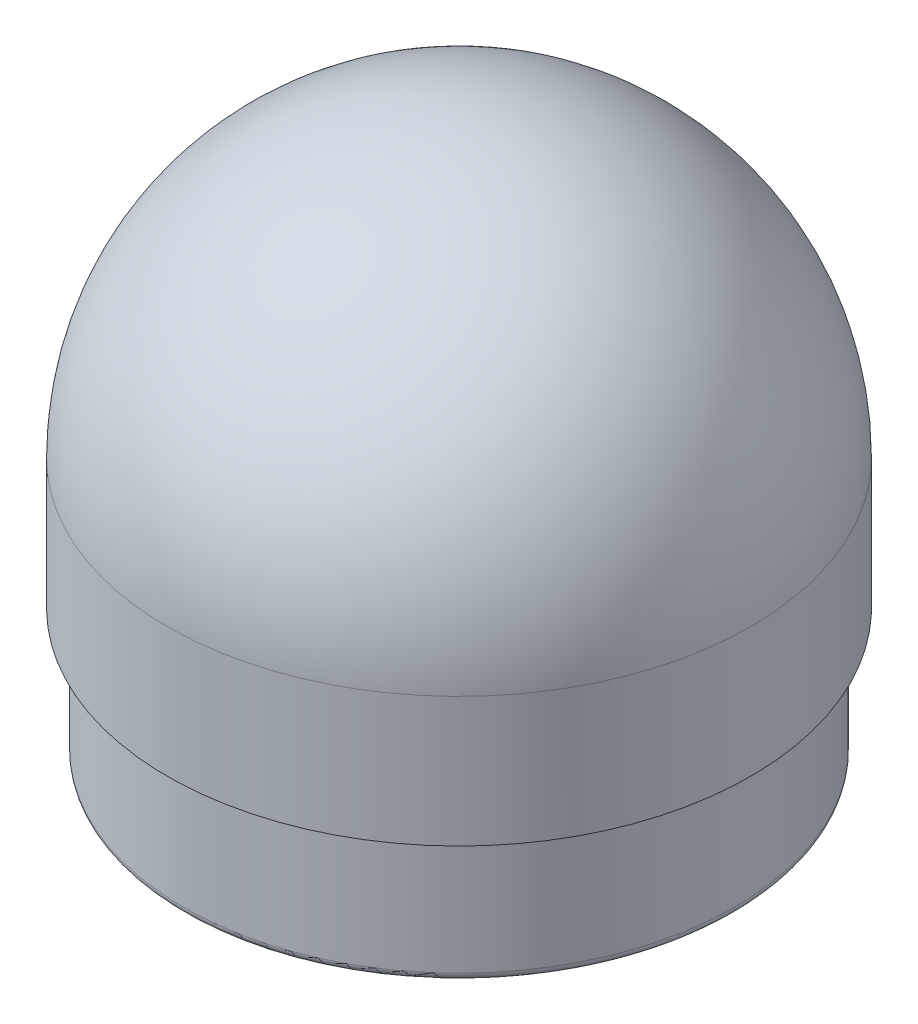
ISO-10303-21;
HEADER;
FILE_DESCRIPTION(('STEP AP214'),'2;1');
FILE_NAME('part.step','',(''),(''),'','','');
FILE_SCHEMA(('AUTOMOTIVE_DESIGN { 1 0 10303 214 1 1 1 1 }'));
ENDSEC;
DATA;
#1=APPLICATION_CONTEXT('core data for automotive mechanical design processes');
#2=APPLICATION_PROTOCOL_DEFINITION('international standard','automotive_design',2000,#1);
#3=PRODUCT_CONTEXT('',#1,'mechanical');
#4=PRODUCT('Part','Part','',(#3));
#5=PRODUCT_RELATED_PRODUCT_CATEGORY('part','',(#4));
#6=PRODUCT_DEFINITION_FORMATION('','',#4);
#7=PRODUCT_DEFINITION_CONTEXT('part definition',#1,'design');
#8=PRODUCT_DEFINITION('design','',#6,#7);
#9=PRODUCT_DEFINITION_SHAPE('','',#8);
#10=(LENGTH_UNIT() NAMED_UNIT(*) SI_UNIT(.MILLI.,.METRE.));
#11=(NAMED_UNIT(*) PLANE_ANGLE_UNIT() SI_UNIT($,.RADIAN.));
#12=(NAMED_UNIT(*) SI_UNIT($,.STERADIAN.) SOLID_ANGLE_UNIT());
#13=UNCERTAINTY_MEASURE_WITH_UNIT(LENGTH_MEASURE(1.E-05),#10,'distance_accuracy_value','');
#14=(GEOMETRIC_REPRESENTATION_CONTEXT(3) GLOBAL_UNCERTAINTY_ASSIGNED_CONTEXT((#13)) GLOBAL_UNIT_ASSIGNED_CONTEXT((#10,
#11,#12)) REPRESENTATION_CONTEXT('',''));
#15=CARTESIAN_POINT('',(0.,0.,0.));
#16=DIRECTION('',(0.,0.,1.));
#17=DIRECTION('',(1.,0.,0.));
#18=AXIS2_PLACEMENT_3D('',#15,#16,#17);
#19=CARTESIAN_POINT('',(0.,98.425,0.));
#20=DIRECTION('',(0.,-1.,0.));
#21=DIRECTION('',(0.,0.,-1.));
#22=AXIS2_PLACEMENT_3D('',#19,#20,#21);
#23=CYLINDRICAL_SURFACE('',#22,47.625);
#24=CARTESIAN_POINT('',(0.,0.,0.));
#25=DIRECTION('',(0.,-1.,0.));
#26=DIRECTION('',(0.,0.,-1.));
#27=AXIS2_PLACEMENT_3D('',#24,#25,#26);
#28=CIRCLE('',#27,47.625);
#29=CARTESIAN_POINT('',(0.,0.,-47.625));
#30=VERTEX_POINT('',#29);
#31=EDGE_CURVE('E10',#30,#30,#28,.T.);
#32=ORIENTED_EDGE('',*,*,#31,.T.);
#33=EDGE_LOOP('',(#32));
#34=FACE_BOUND('',#33,.T.);
#35=CARTESIAN_POINT('',(0.,50.8,0.));
#36=DIRECTION('',(0.,-1.,0.));
#37=DIRECTION('',(0.,0.,-1.));
#38=AXIS2_PLACEMENT_3D('',#35,#36,#37);
#39=CIRCLE('',#38,47.625);
#40=CARTESIAN_POINT('',(0.,50.8,-47.625));
#41=VERTEX_POINT('',#40);
#42=EDGE_CURVE('E56',#41,#41,#39,.T.);
#43=ORIENTED_EDGE('',*,*,#42,.F.);
#44=EDGE_LOOP('',(#43));
#45=FACE_BOUND('',#44,.T.);
#46=ADVANCED_FACE('F31',(#34,#45),#23,.F.);
#47=CARTESIAN_POINT('',(47.625,0.,0.));
#48=DIRECTION('',(0.,-1.,0.));
#49=DIRECTION('',(0.,0.,-1.));
#50=AXIS2_PLACEMENT_3D('',#47,#48,#49);
#51=PLANE('',#50);
#52=CARTESIAN_POINT('',(0.,0.,0.));
#53=DIRECTION('',(0.,-1.,0.));
#54=DIRECTION('',(0.,0.,-1.));
#55=AXIS2_PLACEMENT_3D('',#52,#53,#54);
#56=CIRCLE('',#55,52.3875);
#57=CARTESIAN_POINT('',(0.,0.,-52.3875));
#58=VERTEX_POINT('',#57);
#59=EDGE_CURVE('E37',#58,#58,#56,.T.);
#60=ORIENTED_EDGE('',*,*,#59,.T.);
#61=EDGE_LOOP('',(#60));
#62=FACE_BOUND('',#61,.T.);
#63=ORIENTED_EDGE('',*,*,#31,.F.);
#64=EDGE_LOOP('',(#63));
#65=FACE_BOUND('',#64,.T.);
#66=ADVANCED_FACE('F63',(#62,#65),#51,.T.);
#67=CARTESIAN_POINT('',(0.,1.5875,0.));
#68=DIRECTION('',(0.,-1.,0.));
#69=DIRECTION('',(0.,0.,-1.));
#70=AXIS2_PLACEMENT_3D('',#67,#68,#69);
#71=TOROIDAL_SURFACE('',#70,52.3875,1.5875);
#72=CARTESIAN_POINT('',(0.,1.58750000000001,0.));
#73=DIRECTION('',(0.,-1.,0.));
#74=DIRECTION('',(0.,0.,-1.));
#75=AXIS2_PLACEMENT_3D('',#72,#73,#74);
#76=CIRCLE('',#75,53.975);
#77=CARTESIAN_POINT('',(0.,1.58750000000001,-53.975));
#78=VERTEX_POINT('',#77);
#79=EDGE_CURVE('E41',#78,#78,#76,.T.);
#80=ORIENTED_EDGE('',*,*,#79,.T.);
#81=EDGE_LOOP('',(#80));
#82=FACE_BOUND('',#81,.T.);
#83=ORIENTED_EDGE('',*,*,#59,.F.);
#84=EDGE_LOOP('',(#83));
#85=FACE_BOUND('',#84,.T.);
#86=ADVANCED_FACE('F67',(#82,#85),#71,.T.);
#87=CARTESIAN_POINT('',(0.,98.425,0.));
#88=DIRECTION('',(0.,-1.,0.));
#89=DIRECTION('',(0.,0.,-1.));
#90=AXIS2_PLACEMENT_3D('',#87,#88,#89);
#91=CYLINDRICAL_SURFACE('',#90,53.975);
#92=CARTESIAN_POINT('',(0.,25.4,0.));
#93=DIRECTION('',(0.,-1.,0.));
#94=DIRECTION('',(0.,0.,-1.));
#95=AXIS2_PLACEMENT_3D('',#92,#93,#94);
#96=CIRCLE('',#95,53.975);
#97=CARTESIAN_POINT('',(0.,25.4,-53.975));
#98=VERTEX_POINT('',#97);
#99=EDGE_CURVE('E45',#98,#98,#96,.T.);
#100=ORIENTED_EDGE('',*,*,#99,.T.);
#101=EDGE_LOOP('',(#100));
#102=FACE_BOUND('',#101,.T.);
#103=ORIENTED_EDGE('',*,*,#79,.F.);
#104=EDGE_LOOP('',(#103));
#105=FACE_BOUND('',#104,.T.);
#106=ADVANCED_FACE('F71',(#102,#105),#91,.T.);
#107=CARTESIAN_POINT('',(53.975,25.4,0.));
#108=DIRECTION('',(0.,-1.,0.));
#109=DIRECTION('',(0.,0.,-1.));
#110=AXIS2_PLACEMENT_3D('',#107,#108,#109);
#111=PLANE('',#110);
#112=CARTESIAN_POINT('',(0.,25.4,0.));
#113=DIRECTION('',(0.,-1.,0.));
#114=DIRECTION('',(0.,0.,-1.));
#115=AXIS2_PLACEMENT_3D('',#112,#113,#114);
#116=CIRCLE('',#115,57.15);
#117=CARTESIAN_POINT('',(0.,25.4,-57.15));
#118=VERTEX_POINT('',#117);
#119=EDGE_CURVE('E50',#118,#118,#116,.T.);
#120=ORIENTED_EDGE('',*,*,#119,.T.);
#121=EDGE_LOOP('',(#120));
#122=FACE_BOUND('',#121,.T.);
#123=ORIENTED_EDGE('',*,*,#99,.F.);
#124=EDGE_LOOP('',(#123));
#125=FACE_BOUND('',#124,.T.);
#126=ADVANCED_FACE('F78',(#122,#125),#111,.T.);
#127=CARTESIAN_POINT('',(0.,98.425,0.));
#128=DIRECTION('',(0.,-1.,0.));
#129=DIRECTION('',(0.,0.,-1.));
#130=AXIS2_PLACEMENT_3D('',#127,#128,#129);
#131=CYLINDRICAL_SURFACE('',#130,57.15);
#132=CARTESIAN_POINT('',(0.,50.8,0.));
#133=DIRECTION('',(0.,-1.,0.));
#134=DIRECTION('',(0.,0.,-1.));
#135=AXIS2_PLACEMENT_3D('',#132,#133,#134);
#136=CIRCLE('',#135,57.15);
#137=CARTESIAN_POINT('',(0.,50.8,-57.15));
#138=VERTEX_POINT('',#137);
#139=EDGE_CURVE('E53',#138,#138,#136,.T.);
#140=ORIENTED_EDGE('',*,*,#139,.T.);
#141=EDGE_LOOP('',(#140));
#142=FACE_BOUND('',#141,.T.);
#143=ORIENTED_EDGE('',*,*,#119,.F.);
#144=EDGE_LOOP('',(#143));
#145=FACE_BOUND('',#144,.T.);
#146=ADVANCED_FACE('F82',(#142,#145),#131,.T.);
#147=CARTESIAN_POINT('',(0.,50.8,0.));
#148=DIRECTION('',(0.,-1.,0.));
#149=DIRECTION('',(1.,0.,0.));
#150=AXIS2_PLACEMENT_3D('',#147,#148,#149);
#151=SPHERICAL_SURFACE('',#150,57.15);
#152=ORIENTED_EDGE('',*,*,#139,.F.);
#153=EDGE_LOOP('',(#152));
#154=FACE_BOUND('',#153,.T.);
#155=ADVANCED_FACE('F86',(#154),#151,.T.);
#156=CARTESIAN_POINT('',(0.,50.8,0.));
#157=DIRECTION('',(0.,-1.,0.));
#158=DIRECTION('',(1.,0.,0.));
#159=AXIS2_PLACEMENT_3D('',#156,#157,#158);
#160=SPHERICAL_SURFACE('',#159,47.625);
#161=ORIENTED_EDGE('',*,*,#42,.T.);
#162=EDGE_LOOP('',(#161));
#163=FACE_BOUND('',#162,.T.);
#164=ADVANCED_FACE('F60',(#163),#160,.F.);
#165=CLOSED_SHELL('',(#46,#66,#86,#106,#126,#146,#155,#164));
#166=MANIFOLD_SOLID_BREP('B2',#165);
#167=ADVANCED_BREP_SHAPE_REPRESENTATION('',(#18,#166),#14);
#168=SHAPE_DEFINITION_REPRESENTATION(#9,#167);
ENDSEC;
END-ISO-10303-21;
